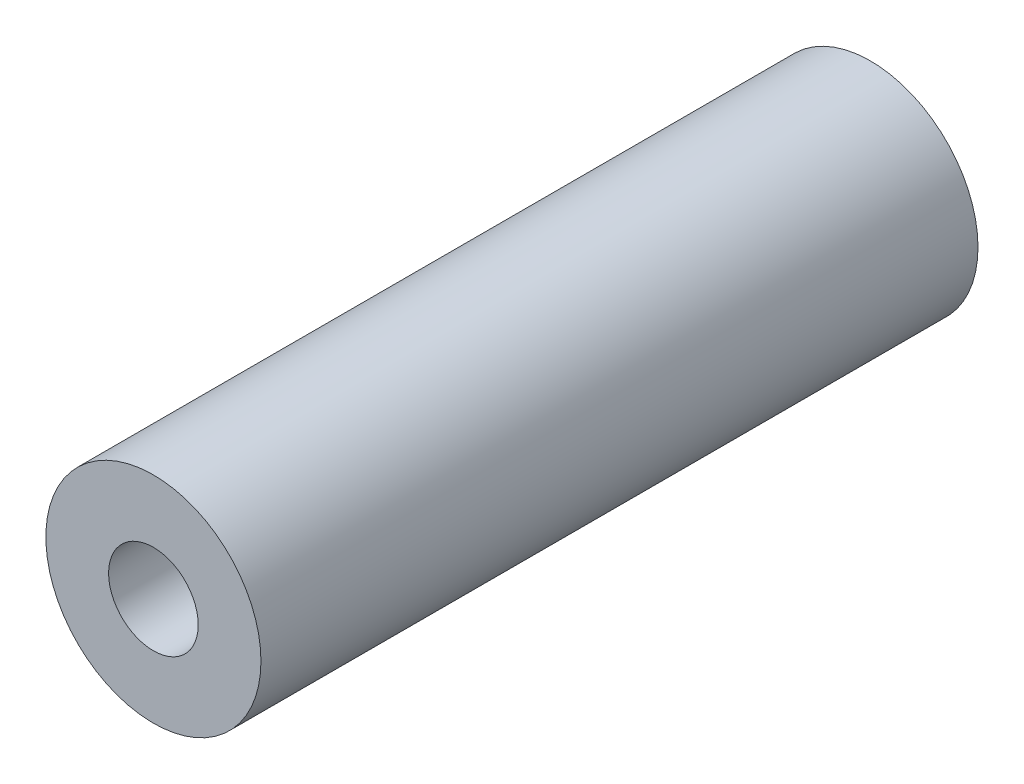
ISO-10303-21;
HEADER;
FILE_DESCRIPTION(('STEP AP214'),'2;1');
FILE_NAME('part.step','',(''),(''),'','','');
FILE_SCHEMA(('AUTOMOTIVE_DESIGN { 1 0 10303 214 1 1 1 1 }'));
ENDSEC;
DATA;
#1=APPLICATION_CONTEXT('core data for automotive mechanical design processes');
#2=APPLICATION_PROTOCOL_DEFINITION('international standard','automotive_design',2000,#1);
#3=PRODUCT_CONTEXT('',#1,'mechanical');
#4=PRODUCT('Part','Part','',(#3));
#5=PRODUCT_RELATED_PRODUCT_CATEGORY('part','',(#4));
#6=PRODUCT_DEFINITION_FORMATION('','',#4);
#7=PRODUCT_DEFINITION_CONTEXT('part definition',#1,'design');
#8=PRODUCT_DEFINITION('design','',#6,#7);
#9=PRODUCT_DEFINITION_SHAPE('','',#8);
#10=(LENGTH_UNIT() NAMED_UNIT(*) SI_UNIT(.MILLI.,.METRE.));
#11=(NAMED_UNIT(*) PLANE_ANGLE_UNIT() SI_UNIT($,.RADIAN.));
#12=(NAMED_UNIT(*) SI_UNIT($,.STERADIAN.) SOLID_ANGLE_UNIT());
#13=UNCERTAINTY_MEASURE_WITH_UNIT(LENGTH_MEASURE(1.E-05),#10,'distance_accuracy_value','');
#14=(GEOMETRIC_REPRESENTATION_CONTEXT(3) GLOBAL_UNCERTAINTY_ASSIGNED_CONTEXT((#13)) GLOBAL_UNIT_ASSIGNED_CONTEXT((#10,
#11,#12)) REPRESENTATION_CONTEXT('',''));
#15=CARTESIAN_POINT('',(0.,0.,0.));
#16=DIRECTION('',(0.,0.,1.));
#17=DIRECTION('',(1.,0.,0.));
#18=AXIS2_PLACEMENT_3D('',#15,#16,#17);
#19=CARTESIAN_POINT('',(0.,0.,10.));
#20=DIRECTION('',(0.,0.,-1.));
#21=DIRECTION('',(-1.,0.,0.));
#22=AXIS2_PLACEMENT_3D('',#19,#20,#21);
#23=CYLINDRICAL_SURFACE('',#22,3.);
#24=CARTESIAN_POINT('',(0.,0.,10.));
#25=DIRECTION('',(0.,0.,1.));
#26=DIRECTION('',(1.,0.,0.));
#27=AXIS2_PLACEMENT_3D('',#24,#25,#26);
#28=CIRCLE('',#27,3.);
#29=CARTESIAN_POINT('',(3.,0.,10.));
#30=VERTEX_POINT('',#29);
#31=EDGE_CURVE('E10',#30,#30,#28,.T.);
#32=ORIENTED_EDGE('',*,*,#31,.F.);
#33=EDGE_LOOP('',(#32));
#34=FACE_BOUND('',#33,.T.);
#35=CARTESIAN_POINT('',(0.,0.,-10.));
#36=DIRECTION('',(0.,0.,1.));
#37=DIRECTION('',(1.,0.,0.));
#38=AXIS2_PLACEMENT_3D('',#35,#36,#37);
#39=CIRCLE('',#38,3.);
#40=CARTESIAN_POINT('',(3.,0.,-10.));
#41=VERTEX_POINT('',#40);
#42=EDGE_CURVE('E37',#41,#41,#39,.T.);
#43=ORIENTED_EDGE('',*,*,#42,.T.);
#44=EDGE_LOOP('',(#43));
#45=FACE_BOUND('',#44,.T.);
#46=ADVANCED_FACE('F34',(#34,#45),#23,.T.);
#47=CARTESIAN_POINT('',(0.,0.,10.));
#48=DIRECTION('',(0.,0.,1.));
#49=DIRECTION('',(1.,0.,0.));
#50=AXIS2_PLACEMENT_3D('',#47,#48,#49);
#51=PLANE('',#50);
#52=CARTESIAN_POINT('',(0.,0.,10.));
#53=DIRECTION('',(0.,0.,1.));
#54=DIRECTION('',(1.,0.,0.));
#55=AXIS2_PLACEMENT_3D('',#52,#53,#54);
#56=CIRCLE('',#55,1.24999999999999);
#57=CARTESIAN_POINT('',(1.24999999999999,0.,10.));
#58=VERTEX_POINT('',#57);
#59=EDGE_CURVE('E48',#58,#58,#56,.T.);
#60=ORIENTED_EDGE('',*,*,#59,.F.);
#61=EDGE_LOOP('',(#60));
#62=FACE_BOUND('',#61,.T.);
#63=ORIENTED_EDGE('',*,*,#31,.T.);
#64=EDGE_LOOP('',(#63));
#65=FACE_BOUND('',#64,.T.);
#66=ADVANCED_FACE('F54',(#62,#65),#51,.T.);
#67=CARTESIAN_POINT('',(0.,0.,-10.));
#68=DIRECTION('',(0.,0.,1.));
#69=DIRECTION('',(1.,0.,0.));
#70=AXIS2_PLACEMENT_3D('',#67,#68,#69);
#71=PLANE('',#70);
#72=CARTESIAN_POINT('',(0.,0.,-10.));
#73=DIRECTION('',(0.,0.,-1.));
#74=DIRECTION('',(-1.,0.,0.));
#75=AXIS2_PLACEMENT_3D('',#72,#73,#74);
#76=CIRCLE('',#75,1.24999999999999);
#77=CARTESIAN_POINT('',(-1.24999999999999,0.,-10.));
#78=VERTEX_POINT('',#77);
#79=EDGE_CURVE('E44',#78,#78,#76,.T.);
#80=ORIENTED_EDGE('',*,*,#79,.F.);
#81=EDGE_LOOP('',(#80));
#82=FACE_BOUND('',#81,.T.);
#83=ORIENTED_EDGE('',*,*,#42,.F.);
#84=EDGE_LOOP('',(#83));
#85=FACE_BOUND('',#84,.T.);
#86=ADVANCED_FACE('F56',(#82,#85),#71,.F.);
#87=CARTESIAN_POINT('',(0.,0.,-10.));
#88=DIRECTION('',(0.,0.,-1.));
#89=DIRECTION('',(-1.,0.,0.));
#90=AXIS2_PLACEMENT_3D('',#87,#88,#89);
#91=CYLINDRICAL_SURFACE('',#90,1.24999999999999);
#92=ORIENTED_EDGE('',*,*,#79,.T.);
#93=EDGE_LOOP('',(#92));
#94=FACE_BOUND('',#93,.T.);
#95=ORIENTED_EDGE('',*,*,#59,.T.);
#96=EDGE_LOOP('',(#95));
#97=FACE_BOUND('',#96,.T.);
#98=ADVANCED_FACE('F52',(#94,#97),#91,.F.);
#99=CLOSED_SHELL('',(#46,#66,#86,#98));
#100=MANIFOLD_SOLID_BREP('B2',#99);
#101=ADVANCED_BREP_SHAPE_REPRESENTATION('',(#18,#100),#14);
#102=SHAPE_DEFINITION_REPRESENTATION(#9,#101);
ENDSEC;
END-ISO-10303-21;
